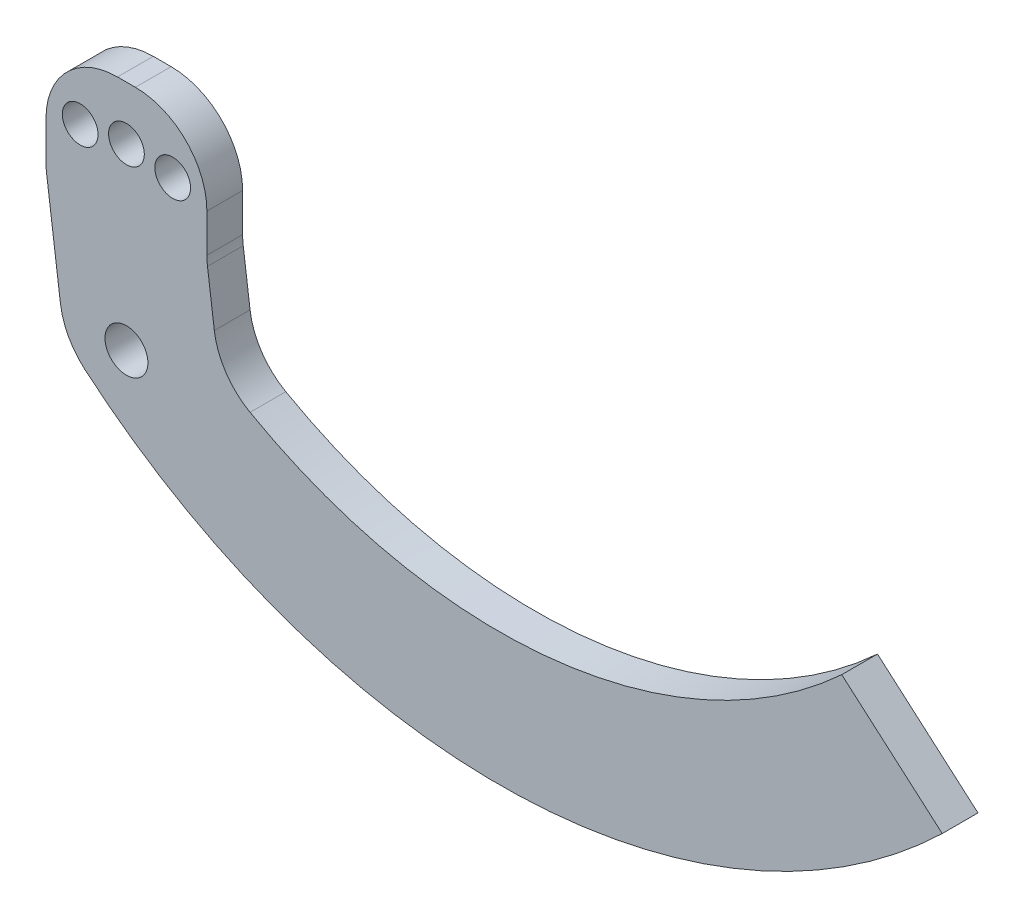
ISO-10303-21;
HEADER;
FILE_DESCRIPTION(('STEP AP214'),'2;1');
FILE_NAME('part.step','',(''),(''),'','','');
FILE_SCHEMA(('AUTOMOTIVE_DESIGN { 1 0 10303 214 1 1 1 1 }'));
ENDSEC;
DATA;
#1=APPLICATION_CONTEXT('core data for automotive mechanical design processes');
#2=APPLICATION_PROTOCOL_DEFINITION('international standard','automotive_design',2000,#1);
#3=PRODUCT_CONTEXT('',#1,'mechanical');
#4=PRODUCT('Part','Part','',(#3));
#5=PRODUCT_RELATED_PRODUCT_CATEGORY('part','',(#4));
#6=PRODUCT_DEFINITION_FORMATION('','',#4);
#7=PRODUCT_DEFINITION_CONTEXT('part definition',#1,'design');
#8=PRODUCT_DEFINITION('design','',#6,#7);
#9=PRODUCT_DEFINITION_SHAPE('','',#8);
#10=(LENGTH_UNIT() NAMED_UNIT(*) SI_UNIT(.MILLI.,.METRE.));
#11=(NAMED_UNIT(*) PLANE_ANGLE_UNIT() SI_UNIT($,.RADIAN.));
#12=(NAMED_UNIT(*) SI_UNIT($,.STERADIAN.) SOLID_ANGLE_UNIT());
#13=UNCERTAINTY_MEASURE_WITH_UNIT(LENGTH_MEASURE(1.E-05),#10,'distance_accuracy_value','');
#14=(GEOMETRIC_REPRESENTATION_CONTEXT(3) GLOBAL_UNCERTAINTY_ASSIGNED_CONTEXT((#13)) GLOBAL_UNIT_ASSIGNED_CONTEXT((#10,
#11,#12)) REPRESENTATION_CONTEXT('',''));
#15=CARTESIAN_POINT('',(0.,0.,0.));
#16=DIRECTION('',(0.,0.,1.));
#17=DIRECTION('',(1.,0.,0.));
#18=AXIS2_PLACEMENT_3D('',#15,#16,#17);
#19=CARTESIAN_POINT('',(104.151932825849,77.9745301846731,5.));
#20=DIRECTION('',(0.,0.,-1.));
#21=DIRECTION('',(-1.,0.,0.));
#22=AXIS2_PLACEMENT_3D('',#19,#20,#21);
#23=PLANE('',#22);
#24=DIRECTION('',(0.,1.,0.));
#25=VECTOR('',#24,1.);
#26=CARTESIAN_POINT('',(22.5,-14.5,5.));
#27=LINE('',#26,#25);
#28=CARTESIAN_POINT('',(22.5,-13.1967370223052,5.));
#29=VERTEX_POINT('',#28);
#30=CARTESIAN_POINT('',(22.5,-2.49999999999996,5.));
#31=VERTEX_POINT('',#30);
#32=EDGE_CURVE('E196',#29,#31,#27,.T.);
#33=ORIENTED_EDGE('',*,*,#32,.T.);
#34=CARTESIAN_POINT('',(2.49999999999998,-2.49999999999996,5.));
#35=DIRECTION('',(0.,0.,-1.));
#36=DIRECTION('',(-1.,0.,0.));
#37=AXIS2_PLACEMENT_3D('',#34,#35,#36);
#38=CIRCLE('',#37,20.);
#39=CARTESIAN_POINT('',(2.50000000000004,17.5,5.));
#40=VERTEX_POINT('',#39);
#41=EDGE_CURVE('E302',#31,#40,#38,.F.);
#42=ORIENTED_EDGE('',*,*,#41,.T.);
#43=DIRECTION('',(-1.,0.,0.));
#44=VECTOR('',#43,1.);
#45=CARTESIAN_POINT('',(22.5,17.5,5.));
#46=LINE('',#45,#44);
#47=CARTESIAN_POINT('',(-2.49999999999995,17.5,5.));
#48=VERTEX_POINT('',#47);
#49=EDGE_CURVE('E370',#40,#48,#46,.T.);
#50=ORIENTED_EDGE('',*,*,#49,.T.);
#51=CARTESIAN_POINT('',(-2.5,-2.49999999999995,5.));
#52=DIRECTION('',(0.,0.,-1.));
#53=DIRECTION('',(-1.,0.,0.));
#54=AXIS2_PLACEMENT_3D('',#51,#52,#53);
#55=CIRCLE('',#54,20.);
#56=CARTESIAN_POINT('',(-22.5,-2.49999999999995,5.));
#57=VERTEX_POINT('',#56);
#58=EDGE_CURVE('E297',#48,#57,#55,.F.);
#59=ORIENTED_EDGE('',*,*,#58,.T.);
#60=DIRECTION('',(0.,-1.,0.));
#61=VECTOR('',#60,1.);
#62=CARTESIAN_POINT('',(-22.5,-14.5,5.));
#63=LINE('',#62,#61);
#64=CARTESIAN_POINT('',(-22.5,-13.1967370223052,5.));
#65=VERTEX_POINT('',#64);
#66=EDGE_CURVE('E374',#57,#65,#63,.T.);
#67=ORIENTED_EDGE('',*,*,#66,.T.);
#68=CARTESIAN_POINT('',(-2.5,-13.1967370223052,5.));
#69=DIRECTION('',(0.,0.,-1.));
#70=DIRECTION('',(-1.,0.,0.));
#71=AXIS2_PLACEMENT_3D('',#68,#69,#70);
#72=CIRCLE('',#71,20.);
#73=CARTESIAN_POINT('',(-22.3308687323697,-15.792241851721,5.));
#74=VERTEX_POINT('',#73);
#75=EDGE_CURVE('E298',#65,#74,#72,.F.);
#76=ORIENTED_EDGE('',*,*,#75,.T.);
#77=DIRECTION('',(0.129775241470791,-0.991543436618486,0.));
#78=VECTOR('',#77,1.);
#79=CARTESIAN_POINT('',(-22.5,-14.5,5.));
#80=LINE('',#79,#78);
#81=CARTESIAN_POINT('',(-18.4658144563932,-45.3230611057261,5.));
#82=VERTEX_POINT('',#81);
#83=EDGE_CURVE('E151',#74,#82,#80,.T.);
#84=ORIENTED_EDGE('',*,*,#83,.T.);
#85=CARTESIAN_POINT('',(1.36505427597654,-42.7275562763103,5.));
#86=DIRECTION('',(0.,0.,-1.));
#87=DIRECTION('',(-1.,0.,0.));
#88=AXIS2_PLACEMENT_3D('',#85,#86,#87);
#89=CIRCLE('',#88,20.);
#90=CARTESIAN_POINT('',(-11.6018317078265,-57.9545017310971,5.));
#91=VERTEX_POINT('',#90);
#92=EDGE_CURVE('E55',#82,#91,#89,.F.);
#93=ORIENTED_EDGE('',*,*,#92,.T.);
#94=CARTESIAN_POINT('',(104.151932825849,77.9745301846731,5.));
#95=DIRECTION('',(0.,0.,1.));
#96=DIRECTION('',(-1.,0.,0.));
#97=AXIS2_PLACEMENT_3D('',#94,#95,#96);
#98=CIRCLE('',#97,178.537491080378);
#99=CARTESIAN_POINT('',(228.193277132872,-50.4364530830474,5.));
#100=VERTEX_POINT('',#99);
#101=EDGE_CURVE('E139',#91,#100,#98,.T.);
#102=ORIENTED_EDGE('',*,*,#101,.T.);
#103=DIRECTION('',(-0.754709580222765,0.656059028990515,0.));
#104=VECTOR('',#103,1.);
#105=CARTESIAN_POINT('',(200.083196534702,-26.0007328201131,5.));
#106=LINE('',#105,#104);
#107=CARTESIAN_POINT('',(200.083196534702,-26.0007328201131,5.));
#108=VERTEX_POINT('',#107);
#109=EDGE_CURVE('E145',#100,#108,#106,.T.);
#110=ORIENTED_EDGE('',*,*,#109,.T.);
#111=CARTESIAN_POINT('',(104.151932825849,77.9745301846731,5.));
#112=DIRECTION('',(0.,0.,-1.));
#113=DIRECTION('',(-1.,0.,0.));
#114=AXIS2_PLACEMENT_3D('',#111,#112,#113);
#115=CIRCLE('',#114,141.469652836543);
#116=CARTESIAN_POINT('',(34.5731969256871,-45.2020186557109,5.));
#117=VERTEX_POINT('',#116);
#118=EDGE_CURVE('E184',#108,#117,#115,.T.);
#119=ORIENTED_EDGE('',*,*,#118,.T.);
#120=CARTESIAN_POINT('',(44.4097568528617,-27.7881710395434,5.));
#121=DIRECTION('',(0.,0.,-1.));
#122=DIRECTION('',(-1.,0.,0.));
#123=AXIS2_PLACEMENT_3D('',#120,#121,#122);
#124=CIRCLE('',#123,20.);
#125=CARTESIAN_POINT('',(24.5788881204919,-30.3836758689592,5.));
#126=VERTEX_POINT('',#125);
#127=EDGE_CURVE('E322',#117,#126,#124,.T.);
#128=ORIENTED_EDGE('',*,*,#127,.T.);
#129=DIRECTION('',(-0.129775241470791,0.991543436618486,0.));
#130=VECTOR('',#129,1.);
#131=CARTESIAN_POINT('',(22.5,-14.5,5.));
#132=LINE('',#131,#130);
#133=CARTESIAN_POINT('',(22.6691312676303,-15.7922418517211,5.));
#134=VERTEX_POINT('',#133);
#135=EDGE_CURVE('E188',#126,#134,#132,.T.);
#136=ORIENTED_EDGE('',*,*,#135,.T.);
#137=CARTESIAN_POINT('',(42.5,-13.1967370223052,5.));
#138=DIRECTION('',(0.,0.,-1.));
#139=DIRECTION('',(-1.,0.,0.));
#140=AXIS2_PLACEMENT_3D('',#137,#138,#139);
#141=CIRCLE('',#140,20.);
#142=EDGE_CURVE('E12',#134,#29,#141,.T.);
#143=ORIENTED_EDGE('',*,*,#142,.T.);
#144=EDGE_LOOP('',(#33,#42,#50,#59,#67,#76,#84,#93,#102,#110,#119,#128,#136,#143));
#145=FACE_BOUND('',#144,.T.);
#146=CARTESIAN_POINT('',(0.,-47.5000000000002,5.));
#147=DIRECTION('',(0.,0.,1.));
#148=DIRECTION('',(1.,0.,0.));
#149=AXIS2_PLACEMENT_3D('',#146,#147,#148);
#150=CIRCLE('',#149,6.);
#151=CARTESIAN_POINT('',(6.,-47.5000000000002,5.));
#152=VERTEX_POINT('',#151);
#153=EDGE_CURVE('E203',#152,#152,#150,.T.);
#154=ORIENTED_EDGE('',*,*,#153,.F.);
#155=EDGE_LOOP('',(#154));
#156=FACE_BOUND('',#155,.T.);
#157=CARTESIAN_POINT('',(-12.9409522551261,0.796291314453579,5.));
#158=DIRECTION('',(0.,0.,1.));
#159=DIRECTION('',(1.,0.,0.));
#160=AXIS2_PLACEMENT_3D('',#157,#158,#159);
#161=CIRCLE('',#160,5.);
#162=CARTESIAN_POINT('',(-7.94095225512607,0.796291314453579,5.));
#163=VERTEX_POINT('',#162);
#164=EDGE_CURVE('E210',#163,#163,#161,.T.);
#165=ORIENTED_EDGE('',*,*,#164,.F.);
#166=EDGE_LOOP('',(#165));
#167=FACE_BOUND('',#166,.T.);
#168=CARTESIAN_POINT('',(0.,2.50000000000043,5.));
#169=DIRECTION('',(0.,0.,1.));
#170=DIRECTION('',(1.,0.,0.));
#171=AXIS2_PLACEMENT_3D('',#168,#169,#170);
#172=CIRCLE('',#171,4.99999999999997);
#173=CARTESIAN_POINT('',(4.99999999999994,2.50000000000043,5.));
#174=VERTEX_POINT('',#173);
#175=EDGE_CURVE('E211',#174,#174,#172,.T.);
#176=ORIENTED_EDGE('',*,*,#175,.F.);
#177=EDGE_LOOP('',(#176));
#178=FACE_BOUND('',#177,.T.);
#179=CARTESIAN_POINT('',(12.9409522551261,0.796291314453357,5.));
#180=DIRECTION('',(0.,0.,1.));
#181=DIRECTION('',(1.,0.,0.));
#182=AXIS2_PLACEMENT_3D('',#179,#180,#181);
#183=CIRCLE('',#182,5.);
#184=CARTESIAN_POINT('',(17.9409522551261,0.796291314453357,5.));
#185=VERTEX_POINT('',#184);
#186=EDGE_CURVE('E219',#185,#185,#183,.T.);
#187=ORIENTED_EDGE('',*,*,#186,.F.);
#188=EDGE_LOOP('',(#187));
#189=FACE_BOUND('',#188,.T.);
#190=ADVANCED_FACE('F38',(#145,#156,#167,#178,#189),#23,.F.);
#191=CARTESIAN_POINT('',(104.151932825849,77.9745301846731,-5.));
#192=DIRECTION('',(0.,0.,-1.));
#193=DIRECTION('',(-1.,0.,0.));
#194=AXIS2_PLACEMENT_3D('',#191,#192,#193);
#195=PLANE('',#194);
#196=CARTESIAN_POINT('',(0.,2.50000000000043,-5.));
#197=DIRECTION('',(0.,0.,1.));
#198=DIRECTION('',(1.,0.,0.));
#199=AXIS2_PLACEMENT_3D('',#196,#197,#198);
#200=CIRCLE('',#199,4.99999999999997);
#201=CARTESIAN_POINT('',(4.99999999999994,2.50000000000043,-5.));
#202=VERTEX_POINT('',#201);
#203=EDGE_CURVE('E216',#202,#202,#200,.T.);
#204=ORIENTED_EDGE('',*,*,#203,.T.);
#205=EDGE_LOOP('',(#204));
#206=FACE_BOUND('',#205,.T.);
#207=CARTESIAN_POINT('',(0.,-47.5000000000002,-5.));
#208=DIRECTION('',(0.,0.,1.));
#209=DIRECTION('',(1.,0.,0.));
#210=AXIS2_PLACEMENT_3D('',#207,#208,#209);
#211=CIRCLE('',#210,6.);
#212=CARTESIAN_POINT('',(6.,-47.5000000000002,-5.));
#213=VERTEX_POINT('',#212);
#214=EDGE_CURVE('E190',#213,#213,#211,.T.);
#215=ORIENTED_EDGE('',*,*,#214,.T.);
#216=EDGE_LOOP('',(#215));
#217=FACE_BOUND('',#216,.T.);
#218=DIRECTION('',(-1.,0.,0.));
#219=VECTOR('',#218,1.);
#220=CARTESIAN_POINT('',(22.5,17.5,-5.));
#221=LINE('',#220,#219);
#222=CARTESIAN_POINT('',(2.50000000000004,17.5,-5.));
#223=VERTEX_POINT('',#222);
#224=CARTESIAN_POINT('',(-2.49999999999995,17.5,-5.));
#225=VERTEX_POINT('',#224);
#226=EDGE_CURVE('E362',#223,#225,#221,.T.);
#227=ORIENTED_EDGE('',*,*,#226,.F.);
#228=CARTESIAN_POINT('',(2.49999999999998,-2.49999999999996,-5.));
#229=DIRECTION('',(0.,0.,-1.));
#230=DIRECTION('',(-1.,0.,0.));
#231=AXIS2_PLACEMENT_3D('',#228,#229,#230);
#232=CIRCLE('',#231,20.);
#233=CARTESIAN_POINT('',(22.5,-2.49999999999996,-5.));
#234=VERTEX_POINT('',#233);
#235=EDGE_CURVE('E305',#223,#234,#232,.T.);
#236=ORIENTED_EDGE('',*,*,#235,.T.);
#237=DIRECTION('',(0.,1.,0.));
#238=VECTOR('',#237,1.);
#239=CARTESIAN_POINT('',(22.5,-14.5,-5.));
#240=LINE('',#239,#238);
#241=CARTESIAN_POINT('',(22.5,-13.1967370223052,-5.));
#242=VERTEX_POINT('',#241);
#243=EDGE_CURVE('E333',#242,#234,#240,.T.);
#244=ORIENTED_EDGE('',*,*,#243,.F.);
#245=CARTESIAN_POINT('',(42.5,-13.1967370223052,-5.));
#246=DIRECTION('',(0.,0.,-1.));
#247=DIRECTION('',(-1.,0.,0.));
#248=AXIS2_PLACEMENT_3D('',#245,#246,#247);
#249=CIRCLE('',#248,20.);
#250=CARTESIAN_POINT('',(22.6691312676303,-15.7922418517211,-5.));
#251=VERTEX_POINT('',#250);
#252=EDGE_CURVE('E48',#242,#251,#249,.F.);
#253=ORIENTED_EDGE('',*,*,#252,.T.);
#254=DIRECTION('',(-0.129775241470791,0.991543436618486,0.));
#255=VECTOR('',#254,1.);
#256=CARTESIAN_POINT('',(22.5,-14.5,-5.));
#257=LINE('',#256,#255);
#258=CARTESIAN_POINT('',(24.5788881204919,-30.3836758689592,-5.));
#259=VERTEX_POINT('',#258);
#260=EDGE_CURVE('E331',#259,#251,#257,.T.);
#261=ORIENTED_EDGE('',*,*,#260,.F.);
#262=CARTESIAN_POINT('',(44.4097568528617,-27.7881710395434,-5.));
#263=DIRECTION('',(0.,0.,-1.));
#264=DIRECTION('',(-1.,0.,0.));
#265=AXIS2_PLACEMENT_3D('',#262,#263,#264);
#266=CIRCLE('',#265,20.);
#267=CARTESIAN_POINT('',(34.5731969256871,-45.2020186557109,-5.));
#268=VERTEX_POINT('',#267);
#269=EDGE_CURVE('E321',#259,#268,#266,.F.);
#270=ORIENTED_EDGE('',*,*,#269,.T.);
#271=CARTESIAN_POINT('',(104.151932825849,77.9745301846731,-5.));
#272=DIRECTION('',(0.,0.,-1.));
#273=DIRECTION('',(-1.,0.,0.));
#274=AXIS2_PLACEMENT_3D('',#271,#272,#273);
#275=CIRCLE('',#274,141.469652836543);
#276=CARTESIAN_POINT('',(200.083196534702,-26.0007328201131,-5.));
#277=VERTEX_POINT('',#276);
#278=EDGE_CURVE('E174',#277,#268,#275,.T.);
#279=ORIENTED_EDGE('',*,*,#278,.F.);
#280=DIRECTION('',(-0.754709580222765,0.656059028990515,0.));
#281=VECTOR('',#280,1.);
#282=CARTESIAN_POINT('',(200.083196534702,-26.0007328201131,-5.));
#283=LINE('',#282,#281);
#284=CARTESIAN_POINT('',(228.193277132872,-50.4364530830474,-5.));
#285=VERTEX_POINT('',#284);
#286=EDGE_CURVE('E189',#285,#277,#283,.T.);
#287=ORIENTED_EDGE('',*,*,#286,.F.);
#288=CARTESIAN_POINT('',(104.151932825849,77.9745301846731,-5.));
#289=DIRECTION('',(0.,0.,1.));
#290=DIRECTION('',(-1.,0.,0.));
#291=AXIS2_PLACEMENT_3D('',#288,#289,#290);
#292=CIRCLE('',#291,178.537491080378);
#293=CARTESIAN_POINT('',(-11.6018317078265,-57.9545017310971,-5.));
#294=VERTEX_POINT('',#293);
#295=EDGE_CURVE('E157',#294,#285,#292,.T.);
#296=ORIENTED_EDGE('',*,*,#295,.F.);
#297=CARTESIAN_POINT('',(1.36505427597654,-42.7275562763103,-5.));
#298=DIRECTION('',(0.,0.,-1.));
#299=DIRECTION('',(-1.,0.,0.));
#300=AXIS2_PLACEMENT_3D('',#297,#298,#299);
#301=CIRCLE('',#300,20.);
#302=CARTESIAN_POINT('',(-18.4658144563932,-45.3230611057261,-5.));
#303=VERTEX_POINT('',#302);
#304=EDGE_CURVE('E358',#294,#303,#301,.T.);
#305=ORIENTED_EDGE('',*,*,#304,.T.);
#306=DIRECTION('',(0.129775241470791,-0.991543436618486,0.));
#307=VECTOR('',#306,1.);
#308=CARTESIAN_POINT('',(-22.5,-14.5,-5.));
#309=LINE('',#308,#307);
#310=CARTESIAN_POINT('',(-22.3308687323697,-15.792241851721,-5.));
#311=VERTEX_POINT('',#310);
#312=EDGE_CURVE('E392',#311,#303,#309,.T.);
#313=ORIENTED_EDGE('',*,*,#312,.F.);
#314=CARTESIAN_POINT('',(-2.5,-13.1967370223052,-5.));
#315=DIRECTION('',(0.,0.,-1.));
#316=DIRECTION('',(-1.,0.,0.));
#317=AXIS2_PLACEMENT_3D('',#314,#315,#316);
#318=CIRCLE('',#317,20.);
#319=CARTESIAN_POINT('',(-22.5,-13.1967370223052,-5.));
#320=VERTEX_POINT('',#319);
#321=EDGE_CURVE('E356',#311,#320,#318,.T.);
#322=ORIENTED_EDGE('',*,*,#321,.T.);
#323=DIRECTION('',(0.,-1.,0.));
#324=VECTOR('',#323,1.);
#325=CARTESIAN_POINT('',(-22.5,-14.5,-5.));
#326=LINE('',#325,#324);
#327=CARTESIAN_POINT('',(-22.5,-2.49999999999995,-5.));
#328=VERTEX_POINT('',#327);
#329=EDGE_CURVE('E391',#328,#320,#326,.T.);
#330=ORIENTED_EDGE('',*,*,#329,.F.);
#331=CARTESIAN_POINT('',(-2.5,-2.49999999999995,-5.));
#332=DIRECTION('',(0.,0.,-1.));
#333=DIRECTION('',(-1.,0.,0.));
#334=AXIS2_PLACEMENT_3D('',#331,#332,#333);
#335=CIRCLE('',#334,20.);
#336=EDGE_CURVE('E360',#328,#225,#335,.T.);
#337=ORIENTED_EDGE('',*,*,#336,.T.);
#338=EDGE_LOOP('',(#227,#236,#244,#253,#261,#270,#279,#287,#296,#305,#313,#322,#330,#337));
#339=FACE_BOUND('',#338,.T.);
#340=CARTESIAN_POINT('',(-12.9409522551261,0.796291314453579,-5.));
#341=DIRECTION('',(0.,0.,1.));
#342=DIRECTION('',(1.,0.,0.));
#343=AXIS2_PLACEMENT_3D('',#340,#341,#342);
#344=CIRCLE('',#343,5.);
#345=CARTESIAN_POINT('',(-7.94095225512607,0.796291314453579,-5.));
#346=VERTEX_POINT('',#345);
#347=EDGE_CURVE('E208',#346,#346,#344,.T.);
#348=ORIENTED_EDGE('',*,*,#347,.T.);
#349=EDGE_LOOP('',(#348));
#350=FACE_BOUND('',#349,.T.);
#351=CARTESIAN_POINT('',(12.9409522551261,0.796291314453357,-5.));
#352=DIRECTION('',(0.,0.,1.));
#353=DIRECTION('',(1.,0.,0.));
#354=AXIS2_PLACEMENT_3D('',#351,#352,#353);
#355=CIRCLE('',#354,5.);
#356=CARTESIAN_POINT('',(17.9409522551261,0.796291314453357,-5.));
#357=VERTEX_POINT('',#356);
#358=EDGE_CURVE('E224',#357,#357,#355,.T.);
#359=ORIENTED_EDGE('',*,*,#358,.T.);
#360=EDGE_LOOP('',(#359));
#361=FACE_BOUND('',#360,.T.);
#362=ADVANCED_FACE('F235',(#206,#217,#339,#350,#361),#195,.T.);
#363=CARTESIAN_POINT('',(104.151932825849,77.9745301846731,5.));
#364=DIRECTION('',(0.,0.,-1.));
#365=DIRECTION('',(-1.,0.,0.));
#366=AXIS2_PLACEMENT_3D('',#363,#364,#365);
#367=CYLINDRICAL_SURFACE('',#366,141.469652836543);
#368=ORIENTED_EDGE('',*,*,#278,.T.);
#369=DIRECTION('',(0.,0.,-1.));
#370=VECTOR('',#369,1.);
#371=CARTESIAN_POINT('',(34.5731969256871,-45.2020186557109,5.));
#372=LINE('',#371,#370);
#373=EDGE_CURVE('E343',#268,#117,#372,.F.);
#374=ORIENTED_EDGE('',*,*,#373,.T.);
#375=ORIENTED_EDGE('',*,*,#118,.F.);
#376=DIRECTION('',(0.,0.,-1.));
#377=VECTOR('',#376,1.);
#378=CARTESIAN_POINT('',(200.083196534702,-26.0007328201131,5.));
#379=LINE('',#378,#377);
#380=EDGE_CURVE('E161',#108,#277,#379,.T.);
#381=ORIENTED_EDGE('',*,*,#380,.T.);
#382=EDGE_LOOP('',(#368,#374,#375,#381));
#383=FACE_BOUND('',#382,.T.);
#384=ADVANCED_FACE('F240',(#383),#367,.F.);
#385=CARTESIAN_POINT('',(22.5,-14.5,5.));
#386=DIRECTION('',(-0.991543436618486,-0.129775241470791,0.));
#387=DIRECTION('',(0.129775241470791,-0.991543436618486,0.));
#388=AXIS2_PLACEMENT_3D('',#385,#386,#387);
#389=PLANE('',#388);
#390=ORIENTED_EDGE('',*,*,#135,.F.);
#391=DIRECTION('',(0.,0.,1.));
#392=VECTOR('',#391,1.);
#393=CARTESIAN_POINT('',(24.5788881204919,-30.3836758689592,-5.));
#394=LINE('',#393,#392);
#395=EDGE_CURVE('E340',#126,#259,#394,.F.);
#396=ORIENTED_EDGE('',*,*,#395,.T.);
#397=ORIENTED_EDGE('',*,*,#260,.T.);
#398=DIRECTION('',(0.,0.,-1.));
#399=VECTOR('',#398,1.);
#400=CARTESIAN_POINT('',(22.6691312676303,-15.7922418517211,5.));
#401=LINE('',#400,#399);
#402=EDGE_CURVE('E160',#251,#134,#401,.F.);
#403=ORIENTED_EDGE('',*,*,#402,.T.);
#404=EDGE_LOOP('',(#390,#396,#397,#403));
#405=FACE_BOUND('',#404,.T.);
#406=ADVANCED_FACE('F265',(#405),#389,.F.);
#407=CARTESIAN_POINT('',(22.5,-14.5,5.));
#408=DIRECTION('',(-1.,0.,0.));
#409=DIRECTION('',(0.,-1.,0.));
#410=AXIS2_PLACEMENT_3D('',#407,#408,#409);
#411=PLANE('',#410);
#412=ORIENTED_EDGE('',*,*,#32,.F.);
#413=DIRECTION('',(0.,0.,-1.));
#414=VECTOR('',#413,1.);
#415=CARTESIAN_POINT('',(22.5,-13.1967370223052,-5.));
#416=LINE('',#415,#414);
#417=EDGE_CURVE('E349',#29,#242,#416,.T.);
#418=ORIENTED_EDGE('',*,*,#417,.T.);
#419=ORIENTED_EDGE('',*,*,#243,.T.);
#420=DIRECTION('',(0.,0.,-1.));
#421=VECTOR('',#420,1.);
#422=CARTESIAN_POINT('',(22.5,-2.49999999999996,5.));
#423=LINE('',#422,#421);
#424=EDGE_CURVE('E347',#234,#31,#423,.F.);
#425=ORIENTED_EDGE('',*,*,#424,.T.);
#426=EDGE_LOOP('',(#412,#418,#419,#425));
#427=FACE_BOUND('',#426,.T.);
#428=ADVANCED_FACE('F261',(#427),#411,.F.);
#429=CARTESIAN_POINT('',(22.5,17.5,5.));
#430=DIRECTION('',(0.,-1.,0.));
#431=DIRECTION('',(1.,0.,0.));
#432=AXIS2_PLACEMENT_3D('',#429,#430,#431);
#433=PLANE('',#432);
#434=ORIENTED_EDGE('',*,*,#49,.F.);
#435=DIRECTION('',(0.,0.,-1.));
#436=VECTOR('',#435,1.);
#437=CARTESIAN_POINT('',(2.50000000000003,17.5,5.));
#438=LINE('',#437,#436);
#439=EDGE_CURVE('E353',#40,#223,#438,.T.);
#440=ORIENTED_EDGE('',*,*,#439,.T.);
#441=ORIENTED_EDGE('',*,*,#226,.T.);
#442=DIRECTION('',(0.,0.,-1.));
#443=VECTOR('',#442,1.);
#444=CARTESIAN_POINT('',(-2.49999999999995,17.5,5.));
#445=LINE('',#444,#443);
#446=EDGE_CURVE('E351',#225,#48,#445,.F.);
#447=ORIENTED_EDGE('',*,*,#446,.T.);
#448=EDGE_LOOP('',(#434,#440,#441,#447));
#449=FACE_BOUND('',#448,.T.);
#450=ADVANCED_FACE('F257',(#449),#433,.F.);
#451=CARTESIAN_POINT('',(-22.5,-14.5,5.));
#452=DIRECTION('',(1.,0.,0.));
#453=DIRECTION('',(0.,1.,0.));
#454=AXIS2_PLACEMENT_3D('',#451,#452,#453);
#455=PLANE('',#454);
#456=ORIENTED_EDGE('',*,*,#66,.F.);
#457=DIRECTION('',(0.,0.,-1.));
#458=VECTOR('',#457,1.);
#459=CARTESIAN_POINT('',(-22.5,-2.49999999999995,5.));
#460=LINE('',#459,#458);
#461=EDGE_CURVE('E313',#57,#328,#460,.T.);
#462=ORIENTED_EDGE('',*,*,#461,.T.);
#463=ORIENTED_EDGE('',*,*,#329,.T.);
#464=DIRECTION('',(0.,0.,-1.));
#465=VECTOR('',#464,1.);
#466=CARTESIAN_POINT('',(-22.5,-13.1967370223052,5.));
#467=LINE('',#466,#465);
#468=EDGE_CURVE('E311',#320,#65,#467,.F.);
#469=ORIENTED_EDGE('',*,*,#468,.T.);
#470=EDGE_LOOP('',(#456,#462,#463,#469));
#471=FACE_BOUND('',#470,.T.);
#472=ADVANCED_FACE('F254',(#471),#455,.F.);
#473=CARTESIAN_POINT('',(-22.5,-14.5,5.));
#474=DIRECTION('',(0.991543436618486,0.129775241470791,0.));
#475=DIRECTION('',(-0.129775241470791,0.991543436618486,0.));
#476=AXIS2_PLACEMENT_3D('',#473,#474,#475);
#477=PLANE('',#476);
#478=ORIENTED_EDGE('',*,*,#312,.T.);
#479=DIRECTION('',(0.,0.,-1.));
#480=VECTOR('',#479,1.);
#481=CARTESIAN_POINT('',(-18.4658144563932,-45.3230611057261,5.));
#482=LINE('',#481,#480);
#483=EDGE_CURVE('E63',#303,#82,#482,.F.);
#484=ORIENTED_EDGE('',*,*,#483,.T.);
#485=ORIENTED_EDGE('',*,*,#83,.F.);
#486=DIRECTION('',(0.,0.,-1.));
#487=VECTOR('',#486,1.);
#488=CARTESIAN_POINT('',(-22.3308687323697,-15.792241851721,5.));
#489=LINE('',#488,#487);
#490=EDGE_CURVE('E317',#74,#311,#489,.T.);
#491=ORIENTED_EDGE('',*,*,#490,.T.);
#492=EDGE_LOOP('',(#478,#484,#485,#491));
#493=FACE_BOUND('',#492,.T.);
#494=ADVANCED_FACE('F251',(#493),#477,.F.);
#495=CARTESIAN_POINT('',(104.151932825849,77.9745301846731,5.));
#496=DIRECTION('',(0.,0.,-1.));
#497=DIRECTION('',(-1.,0.,0.));
#498=AXIS2_PLACEMENT_3D('',#495,#496,#497);
#499=CYLINDRICAL_SURFACE('',#498,178.537491080378);
#500=ORIENTED_EDGE('',*,*,#101,.F.);
#501=DIRECTION('',(0.,0.,-1.));
#502=VECTOR('',#501,1.);
#503=CARTESIAN_POINT('',(-11.6018317078265,-57.9545017310971,5.));
#504=LINE('',#503,#502);
#505=EDGE_CURVE('E295',#91,#294,#504,.T.);
#506=ORIENTED_EDGE('',*,*,#505,.T.);
#507=ORIENTED_EDGE('',*,*,#295,.T.);
#508=DIRECTION('',(0.,0.,-1.));
#509=VECTOR('',#508,1.);
#510=CARTESIAN_POINT('',(228.193277132872,-50.4364530830474,5.));
#511=LINE('',#510,#509);
#512=EDGE_CURVE('E154',#100,#285,#511,.T.);
#513=ORIENTED_EDGE('',*,*,#512,.F.);
#514=EDGE_LOOP('',(#500,#506,#507,#513));
#515=FACE_BOUND('',#514,.T.);
#516=ADVANCED_FACE('F155',(#515),#499,.T.);
#517=CARTESIAN_POINT('',(200.083196534702,-26.0007328201131,5.));
#518=DIRECTION('',(-0.656059028990515,-0.754709580222765,0.));
#519=DIRECTION('',(0.754709580222765,-0.656059028990515,0.));
#520=AXIS2_PLACEMENT_3D('',#517,#518,#519);
#521=PLANE('',#520);
#522=ORIENTED_EDGE('',*,*,#286,.T.);
#523=ORIENTED_EDGE('',*,*,#380,.F.);
#524=ORIENTED_EDGE('',*,*,#109,.F.);
#525=ORIENTED_EDGE('',*,*,#512,.T.);
#526=EDGE_LOOP('',(#522,#523,#524,#525));
#527=FACE_BOUND('',#526,.T.);
#528=ADVANCED_FACE('F163',(#527),#521,.F.);
#529=CARTESIAN_POINT('',(0.,-47.5000000000002,5.));
#530=DIRECTION('',(0.,0.,-1.));
#531=DIRECTION('',(-1.,0.,0.));
#532=AXIS2_PLACEMENT_3D('',#529,#530,#531);
#533=CYLINDRICAL_SURFACE('',#532,6.);
#534=ORIENTED_EDGE('',*,*,#153,.T.);
#535=EDGE_LOOP('',(#534));
#536=FACE_BOUND('',#535,.T.);
#537=ORIENTED_EDGE('',*,*,#214,.F.);
#538=EDGE_LOOP('',(#537));
#539=FACE_BOUND('',#538,.T.);
#540=ADVANCED_FACE('F244',(#536,#539),#533,.F.);
#541=CARTESIAN_POINT('',(-12.9409522551261,0.796291314453579,5.));
#542=DIRECTION('',(0.,0.,-1.));
#543=DIRECTION('',(-1.,0.,0.));
#544=AXIS2_PLACEMENT_3D('',#541,#542,#543);
#545=CYLINDRICAL_SURFACE('',#544,5.);
#546=ORIENTED_EDGE('',*,*,#164,.T.);
#547=EDGE_LOOP('',(#546));
#548=FACE_BOUND('',#547,.T.);
#549=ORIENTED_EDGE('',*,*,#347,.F.);
#550=EDGE_LOOP('',(#549));
#551=FACE_BOUND('',#550,.T.);
#552=ADVANCED_FACE('F413',(#548,#551),#545,.F.);
#553=CARTESIAN_POINT('',(0.,2.50000000000043,5.));
#554=DIRECTION('',(0.,0.,-1.));
#555=DIRECTION('',(-1.,0.,0.));
#556=AXIS2_PLACEMENT_3D('',#553,#554,#555);
#557=CYLINDRICAL_SURFACE('',#556,4.99999999999997);
#558=ORIENTED_EDGE('',*,*,#175,.T.);
#559=EDGE_LOOP('',(#558));
#560=FACE_BOUND('',#559,.T.);
#561=ORIENTED_EDGE('',*,*,#203,.F.);
#562=EDGE_LOOP('',(#561));
#563=FACE_BOUND('',#562,.T.);
#564=ADVANCED_FACE('F408',(#560,#563),#557,.F.);
#565=CARTESIAN_POINT('',(12.9409522551261,0.796291314453357,5.));
#566=DIRECTION('',(0.,0.,-1.));
#567=DIRECTION('',(-1.,0.,0.));
#568=AXIS2_PLACEMENT_3D('',#565,#566,#567);
#569=CYLINDRICAL_SURFACE('',#568,5.);
#570=ORIENTED_EDGE('',*,*,#186,.T.);
#571=EDGE_LOOP('',(#570));
#572=FACE_BOUND('',#571,.T.);
#573=ORIENTED_EDGE('',*,*,#358,.F.);
#574=EDGE_LOOP('',(#573));
#575=FACE_BOUND('',#574,.T.);
#576=ADVANCED_FACE('F231',(#572,#575),#569,.F.);
#577=CARTESIAN_POINT('',(44.4097568528617,-27.7881710395434,5.));
#578=DIRECTION('',(0.,0.,-1.));
#579=DIRECTION('',(-1.,0.,0.));
#580=AXIS2_PLACEMENT_3D('',#577,#578,#579);
#581=CYLINDRICAL_SURFACE('',#580,20.);
#582=ORIENTED_EDGE('',*,*,#127,.F.);
#583=ORIENTED_EDGE('',*,*,#373,.F.);
#584=ORIENTED_EDGE('',*,*,#269,.F.);
#585=ORIENTED_EDGE('',*,*,#395,.F.);
#586=EDGE_LOOP('',(#582,#583,#584,#585));
#587=FACE_BOUND('',#586,.T.);
#588=ADVANCED_FACE('F273',(#587),#581,.F.);
#589=CARTESIAN_POINT('',(42.5,-13.1967370223052,5.));
#590=DIRECTION('',(0.,0.,1.));
#591=DIRECTION('',(1.,0.,0.));
#592=AXIS2_PLACEMENT_3D('',#589,#590,#591);
#593=CYLINDRICAL_SURFACE('',#592,20.);
#594=ORIENTED_EDGE('',*,*,#142,.F.);
#595=ORIENTED_EDGE('',*,*,#402,.F.);
#596=ORIENTED_EDGE('',*,*,#252,.F.);
#597=ORIENTED_EDGE('',*,*,#417,.F.);
#598=EDGE_LOOP('',(#594,#595,#596,#597));
#599=FACE_BOUND('',#598,.T.);
#600=ADVANCED_FACE('F276',(#599),#593,.F.);
#601=CARTESIAN_POINT('',(2.49999999999998,-2.49999999999996,5.));
#602=DIRECTION('',(0.,0.,-1.));
#603=DIRECTION('',(-1.,0.,0.));
#604=AXIS2_PLACEMENT_3D('',#601,#602,#603);
#605=CYLINDRICAL_SURFACE('',#604,20.);
#606=ORIENTED_EDGE('',*,*,#41,.F.);
#607=ORIENTED_EDGE('',*,*,#424,.F.);
#608=ORIENTED_EDGE('',*,*,#235,.F.);
#609=ORIENTED_EDGE('',*,*,#439,.F.);
#610=EDGE_LOOP('',(#606,#607,#608,#609));
#611=FACE_BOUND('',#610,.T.);
#612=ADVANCED_FACE('F280',(#611),#605,.T.);
#613=CARTESIAN_POINT('',(-2.5,-2.49999999999995,5.));
#614=DIRECTION('',(0.,0.,-1.));
#615=DIRECTION('',(-1.,0.,0.));
#616=AXIS2_PLACEMENT_3D('',#613,#614,#615);
#617=CYLINDRICAL_SURFACE('',#616,20.);
#618=ORIENTED_EDGE('',*,*,#58,.F.);
#619=ORIENTED_EDGE('',*,*,#446,.F.);
#620=ORIENTED_EDGE('',*,*,#336,.F.);
#621=ORIENTED_EDGE('',*,*,#461,.F.);
#622=EDGE_LOOP('',(#618,#619,#620,#621));
#623=FACE_BOUND('',#622,.T.);
#624=ADVANCED_FACE('F284',(#623),#617,.T.);
#625=CARTESIAN_POINT('',(1.36505427597654,-42.7275562763103,5.));
#626=DIRECTION('',(0.,0.,-1.));
#627=DIRECTION('',(-1.,0.,0.));
#628=AXIS2_PLACEMENT_3D('',#625,#626,#627);
#629=CYLINDRICAL_SURFACE('',#628,20.);
#630=ORIENTED_EDGE('',*,*,#92,.F.);
#631=ORIENTED_EDGE('',*,*,#483,.F.);
#632=ORIENTED_EDGE('',*,*,#304,.F.);
#633=ORIENTED_EDGE('',*,*,#505,.F.);
#634=EDGE_LOOP('',(#630,#631,#632,#633));
#635=FACE_BOUND('',#634,.T.);
#636=ADVANCED_FACE('F287',(#635),#629,.T.);
#637=CARTESIAN_POINT('',(-2.5,-13.1967370223052,5.));
#638=DIRECTION('',(0.,0.,-1.));
#639=DIRECTION('',(-1.,0.,0.));
#640=AXIS2_PLACEMENT_3D('',#637,#638,#639);
#641=CYLINDRICAL_SURFACE('',#640,20.);
#642=ORIENTED_EDGE('',*,*,#75,.F.);
#643=ORIENTED_EDGE('',*,*,#468,.F.);
#644=ORIENTED_EDGE('',*,*,#321,.F.);
#645=ORIENTED_EDGE('',*,*,#490,.F.);
#646=EDGE_LOOP('',(#642,#643,#644,#645));
#647=FACE_BOUND('',#646,.T.);
#648=ADVANCED_FACE('F40',(#647),#641,.T.);
#649=CLOSED_SHELL('',(#190,#362,#384,#406,#428,#450,#472,#494,#516,#528,#540,#552,#564,#576,
#588,#600,#612,#624,#636,#648));
#650=MANIFOLD_SOLID_BREP('B2',#649);
#651=ADVANCED_BREP_SHAPE_REPRESENTATION('',(#18,#650),#14);
#652=SHAPE_DEFINITION_REPRESENTATION(#9,#651);
ENDSEC;
END-ISO-10303-21;
